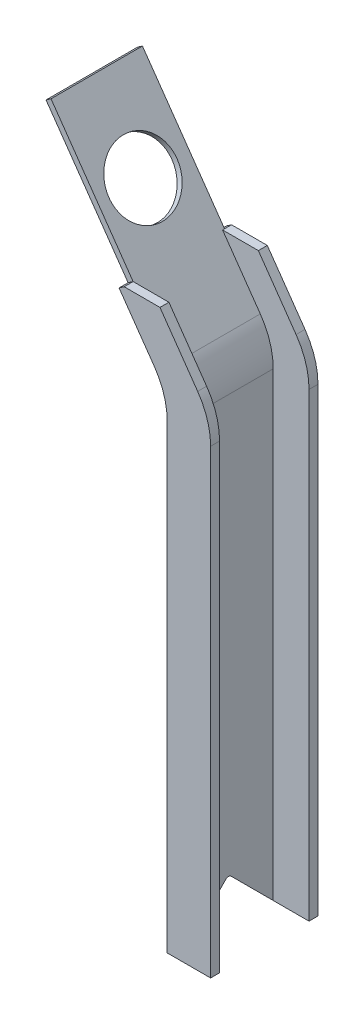
ISO-10303-21;
HEADER;
FILE_DESCRIPTION(('STEP AP214'),'2;1');
FILE_NAME('part.step','',(''),(''),'','','');
FILE_SCHEMA(('AUTOMOTIVE_DESIGN { 1 0 10303 214 1 1 1 1 }'));
ENDSEC;
DATA;
#1=APPLICATION_CONTEXT('core data for automotive mechanical design processes');
#2=APPLICATION_PROTOCOL_DEFINITION('international standard','automotive_design',2000,#1);
#3=PRODUCT_CONTEXT('',#1,'mechanical');
#4=PRODUCT('Part','Part','',(#3));
#5=PRODUCT_RELATED_PRODUCT_CATEGORY('part','',(#4));
#6=PRODUCT_DEFINITION_FORMATION('','',#4);
#7=PRODUCT_DEFINITION_CONTEXT('part definition',#1,'design');
#8=PRODUCT_DEFINITION('design','',#6,#7);
#9=PRODUCT_DEFINITION_SHAPE('','',#8);
#10=(LENGTH_UNIT() NAMED_UNIT(*) SI_UNIT(.MILLI.,.METRE.));
#11=(NAMED_UNIT(*) PLANE_ANGLE_UNIT() SI_UNIT($,.RADIAN.));
#12=(NAMED_UNIT(*) SI_UNIT($,.STERADIAN.) SOLID_ANGLE_UNIT());
#13=UNCERTAINTY_MEASURE_WITH_UNIT(LENGTH_MEASURE(1.E-05),#10,'distance_accuracy_value','');
#14=(GEOMETRIC_REPRESENTATION_CONTEXT(3) GLOBAL_UNCERTAINTY_ASSIGNED_CONTEXT((#13)) GLOBAL_UNIT_ASSIGNED_CONTEXT((#10,
#11,#12)) REPRESENTATION_CONTEXT('',''));
#15=CARTESIAN_POINT('',(0.,0.,0.));
#16=DIRECTION('',(0.,0.,1.));
#17=DIRECTION('',(1.,0.,0.));
#18=AXIS2_PLACEMENT_3D('',#15,#16,#17);
#19=CARTESIAN_POINT('',(5.40602308417781,0.,76.2));
#20=DIRECTION('',(0.,1.,0.));
#21=DIRECTION('',(-1.,0.,0.));
#22=AXIS2_PLACEMENT_3D('',#19,#20,#21);
#23=PLANE('',#22);
#24=DIRECTION('',(1.,0.,0.));
#25=VECTOR('',#24,1.);
#26=CARTESIAN_POINT('',(5.40602308417781,0.,6.35));
#27=LINE('',#26,#25);
#28=CARTESIAN_POINT('',(5.4060230841778,0.,6.35000000000002));
#29=VERTEX_POINT('',#28);
#30=CARTESIAN_POINT('',(30.8060230841778,0.,6.35));
#31=VERTEX_POINT('',#30);
#32=EDGE_CURVE('E277',#29,#31,#27,.T.);
#33=ORIENTED_EDGE('',*,*,#32,.F.);
#34=DIRECTION('',(1.,0.,0.));
#35=VECTOR('',#34,1.);
#36=CARTESIAN_POINT('',(-92.3713628433733,0.,6.35000000000002));
#37=LINE('',#36,#35);
#38=CARTESIAN_POINT('',(0.,0.,6.35000000000002));
#39=VERTEX_POINT('',#38);
#40=EDGE_CURVE('E227',#39,#29,#37,.T.);
#41=ORIENTED_EDGE('',*,*,#40,.F.);
#42=DIRECTION('',(0.,0.,-1.));
#43=VECTOR('',#42,1.);
#44=CARTESIAN_POINT('',(0.,0.,76.2));
#45=LINE('',#44,#43);
#46=CARTESIAN_POINT('',(0.,0.,0.));
#47=VERTEX_POINT('',#46);
#48=EDGE_CURVE('E333',#39,#47,#45,.T.);
#49=ORIENTED_EDGE('',*,*,#48,.T.);
#50=DIRECTION('',(1.,0.,0.));
#51=VECTOR('',#50,1.);
#52=CARTESIAN_POINT('',(5.40602308417781,0.,0.));
#53=LINE('',#52,#51);
#54=CARTESIAN_POINT('',(30.8060230841778,0.,0.));
#55=VERTEX_POINT('',#54);
#56=EDGE_CURVE('E318',#47,#55,#53,.T.);
#57=ORIENTED_EDGE('',*,*,#56,.T.);
#58=DIRECTION('',(0.,0.,-1.));
#59=VECTOR('',#58,1.);
#60=CARTESIAN_POINT('',(30.8060230841778,0.,6.35));
#61=LINE('',#60,#59);
#62=EDGE_CURVE('E314',#31,#55,#61,.T.);
#63=ORIENTED_EDGE('',*,*,#62,.F.);
#64=EDGE_LOOP('',(#33,#41,#49,#57,#63));
#65=FACE_BOUND('',#64,.T.);
#66=ADVANCED_FACE('F47',(#65),#23,.F.);
#67=CARTESIAN_POINT('',(-34.186394319992,391.723230905796,76.2));
#68=DIRECTION('',(0.573576436351037,-0.819152044288998,0.));
#69=DIRECTION('',(0.819152044288998,0.573576436351037,0.));
#70=AXIS2_PLACEMENT_3D('',#67,#68,#69);
#71=PLANE('',#70);
#72=DIRECTION('',(0.81915204428899,0.573576436351048,0.));
#73=VECTOR('',#72,1.);
#74=CARTESIAN_POINT('',(-34.0959969101068,391.786527853633,69.85));
#75=LINE('',#74,#73);
#76=CARTESIAN_POINT('',(-34.0959969101068,391.786527853633,69.85));
#77=VERTEX_POINT('',#76);
#78=CARTESIAN_POINT('',(-30.5588983828669,394.263230905796,69.85));
#79=VERTEX_POINT('',#78);
#80=EDGE_CURVE('E479',#77,#79,#75,.T.);
#81=ORIENTED_EDGE('',*,*,#80,.F.);
#82=DIRECTION('',(0.,0.,-1.));
#83=VECTOR('',#82,1.);
#84=CARTESIAN_POINT('',(-34.0959969101068,391.786527853633,69.85));
#85=LINE('',#84,#83);
#86=CARTESIAN_POINT('',(-34.0959969101068,391.786527853633,4.95491029302109));
#87=VERTEX_POINT('',#86);
#88=EDGE_CURVE('E513',#77,#87,#85,.T.);
#89=ORIENTED_EDGE('',*,*,#88,.T.);
#90=DIRECTION('',(0.81915204428899,0.573576436351048,0.));
#91=VECTOR('',#90,1.);
#92=CARTESIAN_POINT('',(-34.0959969101068,391.786527853633,4.95491029302109));
#93=LINE('',#92,#91);
#94=CARTESIAN_POINT('',(-30.5588983828669,394.263230905796,4.95491029302109));
#95=VERTEX_POINT('',#94);
#96=EDGE_CURVE('E482',#87,#95,#93,.T.);
#97=ORIENTED_EDGE('',*,*,#96,.T.);
#98=DIRECTION('',(0.,0.,-1.));
#99=VECTOR('',#98,1.);
#100=CARTESIAN_POINT('',(-30.5588983828669,394.263230905796,6.35));
#101=LINE('',#100,#99);
#102=CARTESIAN_POINT('',(-30.5588983828669,394.263230905796,0.));
#103=VERTEX_POINT('',#102);
#104=EDGE_CURVE('E296',#95,#103,#101,.T.);
#105=ORIENTED_EDGE('',*,*,#104,.T.);
#106=DIRECTION('',(-0.819152044288998,-0.573576436351037,0.));
#107=VECTOR('',#106,1.);
#108=CARTESIAN_POINT('',(-34.186394319992,391.723230905796,0.));
#109=LINE('',#108,#107);
#110=CARTESIAN_POINT('',(-34.186394319992,391.723230905796,0.));
#111=VERTEX_POINT('',#110);
#112=EDGE_CURVE('E336',#103,#111,#109,.T.);
#113=ORIENTED_EDGE('',*,*,#112,.T.);
#114=DIRECTION('',(0.,0.,-1.));
#115=VECTOR('',#114,1.);
#116=CARTESIAN_POINT('',(-34.186394319992,391.723230905796,76.2));
#117=LINE('',#116,#115);
#118=CARTESIAN_POINT('',(-34.186394319992,391.723230905796,76.2));
#119=VERTEX_POINT('',#118);
#120=EDGE_CURVE('E348',#119,#111,#117,.T.);
#121=ORIENTED_EDGE('',*,*,#120,.F.);
#122=DIRECTION('',(-0.819152044288998,-0.573576436351037,0.));
#123=VECTOR('',#122,1.);
#124=CARTESIAN_POINT('',(-34.186394319992,391.723230905796,76.2));
#125=LINE('',#124,#123);
#126=CARTESIAN_POINT('',(-30.5588983828669,394.263230905796,76.2));
#127=VERTEX_POINT('',#126);
#128=EDGE_CURVE('E322',#127,#119,#125,.T.);
#129=ORIENTED_EDGE('',*,*,#128,.F.);
#130=DIRECTION('',(0.,0.,-1.));
#131=VECTOR('',#130,1.);
#132=CARTESIAN_POINT('',(-30.5588983828669,394.263230905796,76.2));
#133=LINE('',#132,#131);
#134=EDGE_CURVE('E352',#127,#79,#133,.T.);
#135=ORIENTED_EDGE('',*,*,#134,.T.);
#136=EDGE_LOOP('',(#81,#89,#97,#105,#113,#121,#129,#135));
#137=FACE_BOUND('',#136,.T.);
#138=ADVANCED_FACE('F580',(#137),#71,.F.);
#139=CARTESIAN_POINT('',(5.40602308417779,342.9,76.2));
#140=DIRECTION('',(-1.,0.,0.));
#141=DIRECTION('',(0.,-1.,0.));
#142=AXIS2_PLACEMENT_3D('',#139,#140,#141);
#143=PLANE('',#142);
#144=DIRECTION('',(0.,0.707106781186547,-0.707106781186547));
#145=VECTOR('',#144,1.);
#146=CARTESIAN_POINT('',(5.4060230841778,168.275,-98.425));
#147=LINE('',#146,#145);
#148=CARTESIAN_POINT('',(5.40602308417781,0.,69.85));
#149=VERTEX_POINT('',#148);
#150=CARTESIAN_POINT('',(5.40602308417781,29.9539487757863,39.8960512242137));
#151=VERTEX_POINT('',#150);
#152=EDGE_CURVE('E204',#149,#151,#147,.T.);
#153=ORIENTED_EDGE('',*,*,#152,.T.);
#154=CARTESIAN_POINT('',(5.4060230841778,28.1578975515724,38.0999999999999));
#155=DIRECTION('',(-1.,0.,0.));
#156=DIRECTION('',(0.,-1.,0.));
#157=AXIS2_PLACEMENT_3D('',#154,#155,#156);
#158=CIRCLE('',#157,2.54);
#159=CARTESIAN_POINT('',(5.40602308417781,29.9539487757862,36.3039487757861));
#160=VERTEX_POINT('',#159);
#161=EDGE_CURVE('E56',#151,#160,#158,.T.);
#162=ORIENTED_EDGE('',*,*,#161,.T.);
#163=DIRECTION('',(0.,-0.70710678118655,-0.707106781186545));
#164=VECTOR('',#163,1.);
#165=CARTESIAN_POINT('',(5.4060230841778,206.375000000001,212.725));
#166=LINE('',#165,#164);
#167=EDGE_CURVE('E524',#160,#29,#166,.T.);
#168=ORIENTED_EDGE('',*,*,#167,.T.);
#169=DIRECTION('',(0.,-1.,0.));
#170=VECTOR('',#169,1.);
#171=CARTESIAN_POINT('',(5.40602308417779,342.9,6.35));
#172=LINE('',#171,#170);
#173=CARTESIAN_POINT('',(5.40602308417779,326.882821524948,6.35));
#174=VERTEX_POINT('',#173);
#175=EDGE_CURVE('E273',#174,#29,#172,.T.);
#176=ORIENTED_EDGE('',*,*,#175,.F.);
#177=DIRECTION('',(0.,0.,-1.));
#178=VECTOR('',#177,1.);
#179=CARTESIAN_POINT('',(5.40602308417779,326.882821524948,76.2));
#180=LINE('',#179,#178);
#181=CARTESIAN_POINT('',(5.40602308417779,326.882821524948,69.85));
#182=VERTEX_POINT('',#181);
#183=EDGE_CURVE('E234',#174,#182,#180,.F.);
#184=ORIENTED_EDGE('',*,*,#183,.T.);
#185=DIRECTION('',(0.,-1.,0.));
#186=VECTOR('',#185,1.);
#187=CARTESIAN_POINT('',(5.40602308417779,342.9,69.85));
#188=LINE('',#187,#186);
#189=EDGE_CURVE('E230',#182,#149,#188,.T.);
#190=ORIENTED_EDGE('',*,*,#189,.T.);
#191=EDGE_LOOP('',(#153,#162,#168,#176,#184,#190));
#192=FACE_BOUND('',#191,.T.);
#193=ADVANCED_FACE('F231',(#192),#143,.F.);
#194=CARTESIAN_POINT('',(-30.5588983828669,394.263230905796,76.2));
#195=DIRECTION('',(-0.819152044288991,-0.573576436351048,0.));
#196=DIRECTION('',(0.573576436351048,-0.81915204428899,0.));
#197=AXIS2_PLACEMENT_3D('',#194,#195,#196);
#198=PLANE('',#197);
#199=CARTESIAN_POINT('',(-55.3259289045052,429.634216178195,38.1));
#200=DIRECTION('',(0.819152044288991,0.573576436351048,0.));
#201=DIRECTION('',(-0.573576436351048,0.819152044288991,0.));
#202=AXIS2_PLACEMENT_3D('',#199,#200,#201);
#203=CIRCLE('',#202,24.13);
#204=CARTESIAN_POINT('',(-69.166328313656,449.400355006888,38.1));
#205=VERTEX_POINT('',#204);
#206=EDGE_CURVE('E505',#205,#205,#203,.T.);
#207=ORIENTED_EDGE('',*,*,#206,.F.);
#208=EDGE_LOOP('',(#207));
#209=FACE_BOUND('',#208,.T.);
#210=DIRECTION('',(0.573576436351048,-0.81915204428899,0.));
#211=VECTOR('',#210,1.);
#212=CARTESIAN_POINT('',(-30.5588983828669,394.263230905796,69.85));
#213=LINE('',#212,#211);
#214=CARTESIAN_POINT('',(-3.78105306594149,356.020504491581,69.85));
#215=VERTEX_POINT('',#214);
#216=EDGE_CURVE('E259',#79,#215,#213,.T.);
#217=ORIENTED_EDGE('',*,*,#216,.T.);
#218=DIRECTION('',(0.,0.,-1.));
#219=VECTOR('',#218,1.);
#220=CARTESIAN_POINT('',(-3.78105306594147,356.020504491581,76.2));
#221=LINE('',#220,#219);
#222=CARTESIAN_POINT('',(-3.78105306594149,356.020504491581,6.35));
#223=VERTEX_POINT('',#222);
#224=EDGE_CURVE('E376',#215,#223,#221,.T.);
#225=ORIENTED_EDGE('',*,*,#224,.T.);
#226=DIRECTION('',(0.573576436351048,-0.81915204428899,0.));
#227=VECTOR('',#226,1.);
#228=CARTESIAN_POINT('',(-30.5588983828669,394.263230905796,6.35));
#229=LINE('',#228,#227);
#230=CARTESIAN_POINT('',(-30.5588983828669,394.263230905796,6.35000000000002));
#231=VERTEX_POINT('',#230);
#232=EDGE_CURVE('E292',#231,#223,#229,.T.);
#233=ORIENTED_EDGE('',*,*,#232,.F.);
#234=EDGE_CURVE('E306',#231,#95,#101,.T.);
#235=ORIENTED_EDGE('',*,*,#234,.T.);
#236=DIRECTION('',(-0.573576436351048,0.81915204428899,0.));
#237=VECTOR('',#236,1.);
#238=CARTESIAN_POINT('',(-30.5588983828669,394.263230905796,4.95491029302109));
#239=LINE('',#238,#237);
#240=CARTESIAN_POINT('',(-88.8342643161334,477.489078605558,4.95491029302109));
#241=VERTEX_POINT('',#240);
#242=EDGE_CURVE('E497',#95,#241,#239,.T.);
#243=ORIENTED_EDGE('',*,*,#242,.T.);
#244=DIRECTION('',(0.,0.,1.));
#245=VECTOR('',#244,1.);
#246=CARTESIAN_POINT('',(-88.8342643161334,477.489078605558,69.85));
#247=LINE('',#246,#245);
#248=CARTESIAN_POINT('',(-88.8342643161334,477.489078605558,69.85));
#249=VERTEX_POINT('',#248);
#250=EDGE_CURVE('E492',#241,#249,#247,.T.);
#251=ORIENTED_EDGE('',*,*,#250,.T.);
#252=DIRECTION('',(0.573576436351048,-0.81915204428899,0.));
#253=VECTOR('',#252,1.);
#254=CARTESIAN_POINT('',(-30.5588983828669,394.263230905796,69.85));
#255=LINE('',#254,#253);
#256=EDGE_CURVE('E501',#249,#79,#255,.T.);
#257=ORIENTED_EDGE('',*,*,#256,.T.);
#258=EDGE_LOOP('',(#217,#225,#233,#235,#243,#251,#257));
#259=FACE_BOUND('',#258,.T.);
#260=ADVANCED_FACE('F571',(#209,#259),#198,.F.);
#261=CARTESIAN_POINT('',(0.,0.,76.2));
#262=VERTEX_POINT('',#261);
#263=CARTESIAN_POINT('',(0.,0.,69.85));
#264=VERTEX_POINT('',#263);
#265=EDGE_CURVE('E225',#262,#264,#45,.T.);
#266=ORIENTED_EDGE('',*,*,#265,.T.);
#267=DIRECTION('',(1.,0.,0.));
#268=VECTOR('',#267,1.);
#269=CARTESIAN_POINT('',(-92.3713628433733,0.,69.85));
#270=LINE('',#269,#268);
#271=EDGE_CURVE('E208',#264,#149,#270,.T.);
#272=ORIENTED_EDGE('',*,*,#271,.T.);
#273=DIRECTION('',(1.,0.,0.));
#274=VECTOR('',#273,1.);
#275=CARTESIAN_POINT('',(5.40602308417781,0.,69.85));
#276=LINE('',#275,#274);
#277=CARTESIAN_POINT('',(30.8060230841778,0.,69.85));
#278=VERTEX_POINT('',#277);
#279=EDGE_CURVE('E221',#149,#278,#276,.T.);
#280=ORIENTED_EDGE('',*,*,#279,.T.);
#281=DIRECTION('',(0.,0.,-1.));
#282=VECTOR('',#281,1.);
#283=CARTESIAN_POINT('',(30.8060230841778,0.,76.2));
#284=LINE('',#283,#282);
#285=CARTESIAN_POINT('',(30.8060230841778,0.,76.2));
#286=VERTEX_POINT('',#285);
#287=EDGE_CURVE('E268',#286,#278,#284,.T.);
#288=ORIENTED_EDGE('',*,*,#287,.F.);
#289=DIRECTION('',(1.,0.,0.));
#290=VECTOR('',#289,1.);
#291=CARTESIAN_POINT('',(5.40602308417781,0.,76.2));
#292=LINE('',#291,#290);
#293=EDGE_CURVE('E319',#262,#286,#292,.T.);
#294=ORIENTED_EDGE('',*,*,#293,.F.);
#295=EDGE_LOOP('',(#266,#272,#280,#288,#294));
#296=FACE_BOUND('',#295,.T.);
#297=ADVANCED_FACE('F218',(#296),#23,.F.);
#298=CARTESIAN_POINT('',(0.,342.9,76.2));
#299=DIRECTION('',(0.81915204428899,0.573576436351048,0.));
#300=DIRECTION('',(-0.573576436351048,0.81915204428899,0.));
#301=AXIS2_PLACEMENT_3D('',#298,#299,#300);
#302=PLANE('',#301);
#303=DIRECTION('',(0.573576436351048,-0.81915204428899,0.));
#304=VECTOR('',#303,1.);
#305=CARTESIAN_POINT('',(0.,342.9,0.));
#306=LINE('',#305,#304);
#307=CARTESIAN_POINT('',(-9.18707615011929,356.020504491581,0.));
#308=VERTEX_POINT('',#307);
#309=EDGE_CURVE('E339',#111,#308,#306,.T.);
#310=ORIENTED_EDGE('',*,*,#309,.T.);
#311=DIRECTION('',(0.,0.,-1.));
#312=VECTOR('',#311,1.);
#313=CARTESIAN_POINT('',(-9.18707615011929,356.020504491581,76.2));
#314=LINE('',#313,#312);
#315=CARTESIAN_POINT('',(-9.18707615011929,356.020504491581,76.2));
#316=VERTEX_POINT('',#315);
#317=EDGE_CURVE('E360',#308,#316,#314,.F.);
#318=ORIENTED_EDGE('',*,*,#317,.T.);
#319=DIRECTION('',(0.573576436351048,-0.81915204428899,0.));
#320=VECTOR('',#319,1.);
#321=CARTESIAN_POINT('',(0.,342.9,76.2));
#322=LINE('',#321,#320);
#323=EDGE_CURVE('E326',#119,#316,#322,.T.);
#324=ORIENTED_EDGE('',*,*,#323,.F.);
#325=ORIENTED_EDGE('',*,*,#120,.T.);
#326=EDGE_LOOP('',(#310,#318,#324,#325));
#327=FACE_BOUND('',#326,.T.);
#328=ADVANCED_FACE('F616',(#327),#302,.F.);
#329=CARTESIAN_POINT('',(0.,0.,76.2));
#330=DIRECTION('',(1.,0.,0.));
#331=DIRECTION('',(0.,0.,-1.));
#332=AXIS2_PLACEMENT_3D('',#329,#330,#331);
#333=PLANE('',#332);
#334=ORIENTED_EDGE('',*,*,#48,.F.);
#335=DIRECTION('',(0.,0.70710678118655,0.707106781186545));
#336=VECTOR('',#335,1.);
#337=CARTESIAN_POINT('',(0.,34.925,41.2749999999997));
#338=LINE('',#337,#336);
#339=CARTESIAN_POINT('',(0.,29.9539487757863,36.3039487757861));
#340=VERTEX_POINT('',#339);
#341=EDGE_CURVE('E214',#39,#340,#338,.T.);
#342=ORIENTED_EDGE('',*,*,#341,.T.);
#343=CARTESIAN_POINT('',(0.,28.1578975515724,38.0999999999999));
#344=DIRECTION('',(1.,0.,0.));
#345=DIRECTION('',(0.,0.,-1.));
#346=AXIS2_PLACEMENT_3D('',#343,#344,#345);
#347=CIRCLE('',#346,2.54);
#348=CARTESIAN_POINT('',(0.,29.9539487757863,39.8960512242137));
#349=VERTEX_POINT('',#348);
#350=EDGE_CURVE('E11',#340,#349,#347,.T.);
#351=ORIENTED_EDGE('',*,*,#350,.T.);
#352=DIRECTION('',(0.,-0.707106781186547,0.707106781186547));
#353=VECTOR('',#352,1.);
#354=CARTESIAN_POINT('',(0.,-3.175,73.025));
#355=LINE('',#354,#353);
#356=EDGE_CURVE('E215',#349,#264,#355,.T.);
#357=ORIENTED_EDGE('',*,*,#356,.T.);
#358=ORIENTED_EDGE('',*,*,#265,.F.);
#359=DIRECTION('',(0.,-1.,0.));
#360=VECTOR('',#359,1.);
#361=CARTESIAN_POINT('',(0.,0.,76.2));
#362=LINE('',#361,#360);
#363=CARTESIAN_POINT('',(0.,326.882821524948,76.2));
#364=VERTEX_POINT('',#363);
#365=EDGE_CURVE('E330',#364,#262,#362,.T.);
#366=ORIENTED_EDGE('',*,*,#365,.F.);
#367=DIRECTION('',(0.,0.,-1.));
#368=VECTOR('',#367,1.);
#369=CARTESIAN_POINT('',(0.,326.882821524948,0.));
#370=LINE('',#369,#368);
#371=CARTESIAN_POINT('',(0.,326.882821524948,0.));
#372=VERTEX_POINT('',#371);
#373=EDGE_CURVE('E356',#364,#372,#370,.T.);
#374=ORIENTED_EDGE('',*,*,#373,.T.);
#375=DIRECTION('',(0.,-1.,0.));
#376=VECTOR('',#375,1.);
#377=CARTESIAN_POINT('',(0.,0.,0.));
#378=LINE('',#377,#376);
#379=EDGE_CURVE('E323',#372,#47,#378,.T.);
#380=ORIENTED_EDGE('',*,*,#379,.T.);
#381=EDGE_LOOP('',(#334,#342,#351,#357,#358,#366,#374,#380));
#382=FACE_BOUND('',#381,.T.);
#383=ADVANCED_FACE('F621',(#382),#333,.F.);
#384=CARTESIAN_POINT('',(0.,0.,76.2));
#385=DIRECTION('',(0.,0.,-1.));
#386=DIRECTION('',(-1.,0.,0.));
#387=AXIS2_PLACEMENT_3D('',#384,#385,#386);
#388=PLANE('',#387);
#389=DIRECTION('',(0.,1.,0.));
#390=VECTOR('',#389,1.);
#391=CARTESIAN_POINT('',(30.8060230841778,0.,76.2));
#392=LINE('',#391,#390);
#393=CARTESIAN_POINT('',(30.8060230841778,326.882821524948,76.2));
#394=VERTEX_POINT('',#393);
#395=EDGE_CURVE('E263',#286,#394,#392,.T.);
#396=ORIENTED_EDGE('',*,*,#395,.T.);
#397=CARTESIAN_POINT('',(-19.9939769158222,326.882821524948,76.2));
#398=DIRECTION('',(0.,0.,-1.));
#399=DIRECTION('',(-1.,0.,0.));
#400=AXIS2_PLACEMENT_3D('',#397,#398,#399);
#401=CIRCLE('',#400,50.8);
#402=CARTESIAN_POINT('',(21.6189469340585,356.020504491581,76.2));
#403=VERTEX_POINT('',#402);
#404=EDGE_CURVE('E392',#394,#403,#401,.F.);
#405=ORIENTED_EDGE('',*,*,#404,.T.);
#406=DIRECTION('',(-0.573576436351048,0.81915204428899,0.));
#407=VECTOR('',#406,1.);
#408=CARTESIAN_POINT('',(30.8060230841778,342.9,76.2));
#409=LINE('',#408,#407);
#410=CARTESIAN_POINT('',(-5.15889838286693,394.263230905796,76.2));
#411=VERTEX_POINT('',#410);
#412=EDGE_CURVE('E464',#403,#411,#409,.T.);
#413=ORIENTED_EDGE('',*,*,#412,.T.);
#414=DIRECTION('',(-1.,0.,0.));
#415=VECTOR('',#414,1.);
#416=CARTESIAN_POINT('',(-5.15889838286693,394.263230905796,76.2));
#417=LINE('',#416,#415);
#418=EDGE_CURVE('E269',#411,#127,#417,.T.);
#419=ORIENTED_EDGE('',*,*,#418,.T.);
#420=ORIENTED_EDGE('',*,*,#128,.T.);
#421=ORIENTED_EDGE('',*,*,#323,.T.);
#422=CARTESIAN_POINT('',(-50.8,326.882821524948,76.2));
#423=DIRECTION('',(0.,0.,-1.));
#424=DIRECTION('',(-1.,0.,0.));
#425=AXIS2_PLACEMENT_3D('',#422,#423,#424);
#426=CIRCLE('',#425,50.8);
#427=EDGE_CURVE('E398',#316,#364,#426,.T.);
#428=ORIENTED_EDGE('',*,*,#427,.T.);
#429=ORIENTED_EDGE('',*,*,#365,.T.);
#430=ORIENTED_EDGE('',*,*,#293,.T.);
#431=EDGE_LOOP('',(#396,#405,#413,#419,#420,#421,#428,#429,#430));
#432=FACE_BOUND('',#431,.T.);
#433=ADVANCED_FACE('F585',(#432),#388,.F.);
#434=CARTESIAN_POINT('',(0.,0.,0.));
#435=DIRECTION('',(0.,0.,-1.));
#436=DIRECTION('',(-1.,0.,0.));
#437=AXIS2_PLACEMENT_3D('',#434,#435,#436);
#438=PLANE('',#437);
#439=DIRECTION('',(-0.573576436351048,0.81915204428899,0.));
#440=VECTOR('',#439,1.);
#441=CARTESIAN_POINT('',(30.8060230841778,342.9,0.));
#442=LINE('',#441,#440);
#443=CARTESIAN_POINT('',(21.6189469340585,356.020504491581,0.));
#444=VERTEX_POINT('',#443);
#445=CARTESIAN_POINT('',(-5.15889838286693,394.263230905796,0.));
#446=VERTEX_POINT('',#445);
#447=EDGE_CURVE('E300',#444,#446,#442,.T.);
#448=ORIENTED_EDGE('',*,*,#447,.F.);
#449=CARTESIAN_POINT('',(-19.9939769158222,326.882821524948,0.));
#450=DIRECTION('',(0.,0.,-1.));
#451=DIRECTION('',(-1.,0.,0.));
#452=AXIS2_PLACEMENT_3D('',#449,#450,#451);
#453=CIRCLE('',#452,50.8);
#454=CARTESIAN_POINT('',(30.8060230841778,326.882821524948,0.));
#455=VERTEX_POINT('',#454);
#456=EDGE_CURVE('E367',#444,#455,#453,.T.);
#457=ORIENTED_EDGE('',*,*,#456,.T.);
#458=DIRECTION('',(0.,1.,0.));
#459=VECTOR('',#458,1.);
#460=CARTESIAN_POINT('',(30.8060230841778,0.,0.));
#461=LINE('',#460,#459);
#462=EDGE_CURVE('E272',#55,#455,#461,.T.);
#463=ORIENTED_EDGE('',*,*,#462,.F.);
#464=ORIENTED_EDGE('',*,*,#56,.F.);
#465=ORIENTED_EDGE('',*,*,#379,.F.);
#466=CARTESIAN_POINT('',(-50.8,326.882821524948,0.));
#467=DIRECTION('',(0.,0.,-1.));
#468=DIRECTION('',(-1.,0.,0.));
#469=AXIS2_PLACEMENT_3D('',#466,#467,#468);
#470=CIRCLE('',#469,50.8);
#471=EDGE_CURVE('E395',#372,#308,#470,.F.);
#472=ORIENTED_EDGE('',*,*,#471,.T.);
#473=ORIENTED_EDGE('',*,*,#309,.F.);
#474=ORIENTED_EDGE('',*,*,#112,.F.);
#475=DIRECTION('',(-1.,0.,0.));
#476=VECTOR('',#475,1.);
#477=CARTESIAN_POINT('',(-5.15889838286693,394.263230905796,0.));
#478=LINE('',#477,#476);
#479=EDGE_CURVE('E278',#446,#103,#478,.T.);
#480=ORIENTED_EDGE('',*,*,#479,.F.);
#481=EDGE_LOOP('',(#448,#457,#463,#464,#465,#472,#473,#474,#480));
#482=FACE_BOUND('',#481,.T.);
#483=ADVANCED_FACE('F562',(#482),#438,.T.);
#484=CARTESIAN_POINT('',(30.8060230841778,0.,6.35));
#485=DIRECTION('',(-1.,0.,0.));
#486=DIRECTION('',(0.,0.,1.));
#487=AXIS2_PLACEMENT_3D('',#484,#485,#486);
#488=PLANE('',#487);
#489=ORIENTED_EDGE('',*,*,#462,.T.);
#490=DIRECTION('',(0.,0.,-1.));
#491=VECTOR('',#490,1.);
#492=CARTESIAN_POINT('',(30.8060230841778,326.882821524948,6.35));
#493=LINE('',#492,#491);
#494=CARTESIAN_POINT('',(30.8060230841778,326.882821524948,6.35));
#495=VERTEX_POINT('',#494);
#496=EDGE_CURVE('E370',#455,#495,#493,.F.);
#497=ORIENTED_EDGE('',*,*,#496,.T.);
#498=DIRECTION('',(0.,1.,0.));
#499=VECTOR('',#498,1.);
#500=CARTESIAN_POINT('',(30.8060230841778,0.,6.35));
#501=LINE('',#500,#499);
#502=EDGE_CURVE('E281',#31,#495,#501,.T.);
#503=ORIENTED_EDGE('',*,*,#502,.F.);
#504=ORIENTED_EDGE('',*,*,#62,.T.);
#505=EDGE_LOOP('',(#489,#497,#503,#504));
#506=FACE_BOUND('',#505,.T.);
#507=ADVANCED_FACE('F549',(#506),#488,.F.);
#508=CARTESIAN_POINT('',(30.8060230841778,342.9,6.35));
#509=DIRECTION('',(-0.81915204428899,-0.573576436351048,0.));
#510=DIRECTION('',(0.573576436351048,-0.819152044288991,0.));
#511=AXIS2_PLACEMENT_3D('',#508,#509,#510);
#512=PLANE('',#511);
#513=DIRECTION('',(-0.573576436351048,0.81915204428899,0.));
#514=VECTOR('',#513,1.);
#515=CARTESIAN_POINT('',(30.8060230841778,342.9,6.35));
#516=LINE('',#515,#514);
#517=CARTESIAN_POINT('',(21.6189469340585,356.020504491581,6.35));
#518=VERTEX_POINT('',#517);
#519=CARTESIAN_POINT('',(-5.15889838286693,394.263230905796,6.35));
#520=VERTEX_POINT('',#519);
#521=EDGE_CURVE('E285',#518,#520,#516,.T.);
#522=ORIENTED_EDGE('',*,*,#521,.F.);
#523=DIRECTION('',(0.,0.,-1.));
#524=VECTOR('',#523,1.);
#525=CARTESIAN_POINT('',(21.6189469340585,356.020504491581,6.35));
#526=LINE('',#525,#524);
#527=EDGE_CURVE('E363',#518,#444,#526,.T.);
#528=ORIENTED_EDGE('',*,*,#527,.T.);
#529=ORIENTED_EDGE('',*,*,#447,.T.);
#530=DIRECTION('',(0.,0.,-1.));
#531=VECTOR('',#530,1.);
#532=CARTESIAN_POINT('',(-5.15889838286693,394.263230905796,6.35));
#533=LINE('',#532,#531);
#534=EDGE_CURVE('E310',#520,#446,#533,.T.);
#535=ORIENTED_EDGE('',*,*,#534,.F.);
#536=EDGE_LOOP('',(#522,#528,#529,#535));
#537=FACE_BOUND('',#536,.T.);
#538=ADVANCED_FACE('F558',(#537),#512,.F.);
#539=CARTESIAN_POINT('',(-5.15889838286693,394.263230905796,6.35));
#540=DIRECTION('',(0.,-1.,0.));
#541=DIRECTION('',(0.,0.,-1.));
#542=AXIS2_PLACEMENT_3D('',#539,#540,#541);
#543=PLANE('',#542);
#544=ORIENTED_EDGE('',*,*,#479,.T.);
#545=ORIENTED_EDGE('',*,*,#104,.F.);
#546=ORIENTED_EDGE('',*,*,#234,.F.);
#547=DIRECTION('',(-1.,0.,0.));
#548=VECTOR('',#547,1.);
#549=CARTESIAN_POINT('',(-5.15889838286693,394.263230905796,6.35));
#550=LINE('',#549,#548);
#551=EDGE_CURVE('E288',#520,#231,#550,.T.);
#552=ORIENTED_EDGE('',*,*,#551,.F.);
#553=ORIENTED_EDGE('',*,*,#534,.T.);
#554=EDGE_LOOP('',(#544,#545,#546,#552,#553));
#555=FACE_BOUND('',#554,.T.);
#556=ADVANCED_FACE('F567',(#555),#543,.F.);
#557=CARTESIAN_POINT('',(0.,0.,6.35));
#558=DIRECTION('',(0.,0.,1.));
#559=DIRECTION('',(1.,0.,0.));
#560=AXIS2_PLACEMENT_3D('',#557,#558,#559);
#561=PLANE('',#560);
#562=ORIENTED_EDGE('',*,*,#502,.T.);
#563=CARTESIAN_POINT('',(-19.9939769158222,326.882821524948,6.35));
#564=DIRECTION('',(0.,0.,1.));
#565=DIRECTION('',(1.,0.,0.));
#566=AXIS2_PLACEMENT_3D('',#563,#564,#565);
#567=CIRCLE('',#566,50.8);
#568=EDGE_CURVE('E373',#495,#518,#567,.T.);
#569=ORIENTED_EDGE('',*,*,#568,.T.);
#570=ORIENTED_EDGE('',*,*,#521,.T.);
#571=ORIENTED_EDGE('',*,*,#551,.T.);
#572=ORIENTED_EDGE('',*,*,#232,.T.);
#573=CARTESIAN_POINT('',(-45.3939769158222,326.882821524948,6.34999999999999));
#574=DIRECTION('',(0.,0.,1.));
#575=DIRECTION('',(1.,0.,0.));
#576=AXIS2_PLACEMENT_3D('',#573,#574,#575);
#577=CIRCLE('',#576,50.8);
#578=EDGE_CURVE('E401',#223,#174,#577,.F.);
#579=ORIENTED_EDGE('',*,*,#578,.T.);
#580=ORIENTED_EDGE('',*,*,#175,.T.);
#581=ORIENTED_EDGE('',*,*,#32,.T.);
#582=EDGE_LOOP('',(#562,#569,#570,#571,#572,#579,#580,#581));
#583=FACE_BOUND('',#582,.T.);
#584=ADVANCED_FACE('F543',(#583),#561,.T.);
#585=CARTESIAN_POINT('',(30.8060230841778,0.,76.2));
#586=DIRECTION('',(-1.,0.,0.));
#587=DIRECTION('',(0.,0.,1.));
#588=AXIS2_PLACEMENT_3D('',#585,#586,#587);
#589=PLANE('',#588);
#590=DIRECTION('',(0.,1.,0.));
#591=VECTOR('',#590,1.);
#592=CARTESIAN_POINT('',(30.8060230841778,0.,69.85));
#593=LINE('',#592,#591);
#594=CARTESIAN_POINT('',(30.8060230841778,326.882821524948,69.85));
#595=VERTEX_POINT('',#594);
#596=EDGE_CURVE('E244',#278,#595,#593,.T.);
#597=ORIENTED_EDGE('',*,*,#596,.T.);
#598=DIRECTION('',(0.,0.,-1.));
#599=VECTOR('',#598,1.);
#600=CARTESIAN_POINT('',(30.8060230841778,326.882821524948,76.2));
#601=LINE('',#600,#599);
#602=EDGE_CURVE('E389',#595,#394,#601,.F.);
#603=ORIENTED_EDGE('',*,*,#602,.T.);
#604=ORIENTED_EDGE('',*,*,#395,.F.);
#605=ORIENTED_EDGE('',*,*,#287,.T.);
#606=EDGE_LOOP('',(#597,#603,#604,#605));
#607=FACE_BOUND('',#606,.T.);
#608=ADVANCED_FACE('F594',(#607),#589,.F.);
#609=CARTESIAN_POINT('',(30.8060230841778,342.9,76.2));
#610=DIRECTION('',(-0.81915204428899,-0.573576436351048,0.));
#611=DIRECTION('',(0.573576436351048,-0.819152044288991,0.));
#612=AXIS2_PLACEMENT_3D('',#609,#610,#611);
#613=PLANE('',#612);
#614=ORIENTED_EDGE('',*,*,#412,.F.);
#615=DIRECTION('',(0.,0.,-1.));
#616=VECTOR('',#615,1.);
#617=CARTESIAN_POINT('',(21.6189469340585,356.020504491581,76.2));
#618=LINE('',#617,#616);
#619=CARTESIAN_POINT('',(21.6189469340585,356.020504491581,69.85));
#620=VERTEX_POINT('',#619);
#621=EDGE_CURVE('E382',#403,#620,#618,.T.);
#622=ORIENTED_EDGE('',*,*,#621,.T.);
#623=DIRECTION('',(-0.573576436351048,0.81915204428899,0.));
#624=VECTOR('',#623,1.);
#625=CARTESIAN_POINT('',(30.8060230841778,342.9,69.85));
#626=LINE('',#625,#624);
#627=CARTESIAN_POINT('',(-5.15889838286693,394.263230905796,69.85));
#628=VERTEX_POINT('',#627);
#629=EDGE_CURVE('E249',#620,#628,#626,.T.);
#630=ORIENTED_EDGE('',*,*,#629,.T.);
#631=DIRECTION('',(0.,0.,-1.));
#632=VECTOR('',#631,1.);
#633=CARTESIAN_POINT('',(-5.15889838286693,394.263230905796,76.2));
#634=LINE('',#633,#632);
#635=EDGE_CURVE('E264',#411,#628,#634,.T.);
#636=ORIENTED_EDGE('',*,*,#635,.F.);
#637=EDGE_LOOP('',(#614,#622,#630,#636));
#638=FACE_BOUND('',#637,.T.);
#639=ADVANCED_FACE('F590',(#638),#613,.F.);
#640=CARTESIAN_POINT('',(-5.15889838286693,394.263230905796,76.2));
#641=DIRECTION('',(0.,-1.,0.));
#642=DIRECTION('',(0.,0.,-1.));
#643=AXIS2_PLACEMENT_3D('',#640,#641,#642);
#644=PLANE('',#643);
#645=DIRECTION('',(-1.,0.,0.));
#646=VECTOR('',#645,1.);
#647=CARTESIAN_POINT('',(-5.15889838286693,394.263230905796,69.85));
#648=LINE('',#647,#646);
#649=EDGE_CURVE('E255',#628,#79,#648,.T.);
#650=ORIENTED_EDGE('',*,*,#649,.T.);
#651=ORIENTED_EDGE('',*,*,#134,.F.);
#652=ORIENTED_EDGE('',*,*,#418,.F.);
#653=ORIENTED_EDGE('',*,*,#635,.T.);
#654=EDGE_LOOP('',(#650,#651,#652,#653));
#655=FACE_BOUND('',#654,.T.);
#656=ADVANCED_FACE('F584',(#655),#644,.F.);
#657=CARTESIAN_POINT('',(0.,0.,69.85));
#658=DIRECTION('',(0.,0.,1.));
#659=DIRECTION('',(1.,0.,0.));
#660=AXIS2_PLACEMENT_3D('',#657,#658,#659);
#661=PLANE('',#660);
#662=ORIENTED_EDGE('',*,*,#629,.F.);
#663=CARTESIAN_POINT('',(-19.9939769158222,326.882821524948,69.85));
#664=DIRECTION('',(0.,0.,1.));
#665=DIRECTION('',(1.,0.,0.));
#666=AXIS2_PLACEMENT_3D('',#663,#664,#665);
#667=CIRCLE('',#666,50.8);
#668=EDGE_CURVE('E386',#620,#595,#667,.F.);
#669=ORIENTED_EDGE('',*,*,#668,.T.);
#670=ORIENTED_EDGE('',*,*,#596,.F.);
#671=ORIENTED_EDGE('',*,*,#279,.F.);
#672=ORIENTED_EDGE('',*,*,#189,.F.);
#673=CARTESIAN_POINT('',(-45.3939769158222,326.882821524948,69.85));
#674=DIRECTION('',(0.,0.,1.));
#675=DIRECTION('',(1.,0.,0.));
#676=AXIS2_PLACEMENT_3D('',#673,#674,#675);
#677=CIRCLE('',#676,50.8);
#678=EDGE_CURVE('E404',#182,#215,#677,.T.);
#679=ORIENTED_EDGE('',*,*,#678,.T.);
#680=ORIENTED_EDGE('',*,*,#216,.F.);
#681=ORIENTED_EDGE('',*,*,#649,.F.);
#682=EDGE_LOOP('',(#662,#669,#670,#671,#672,#679,#680,#681));
#683=FACE_BOUND('',#682,.T.);
#684=ADVANCED_FACE('F242',(#683),#661,.F.);
#685=CARTESIAN_POINT('',(-50.8,326.882821524948,76.2));
#686=DIRECTION('',(0.,0.,1.));
#687=DIRECTION('',(1.,0.,0.));
#688=AXIS2_PLACEMENT_3D('',#685,#686,#687);
#689=CYLINDRICAL_SURFACE('',#688,50.8);
#690=ORIENTED_EDGE('',*,*,#427,.F.);
#691=ORIENTED_EDGE('',*,*,#317,.F.);
#692=ORIENTED_EDGE('',*,*,#471,.F.);
#693=ORIENTED_EDGE('',*,*,#373,.F.);
#694=EDGE_LOOP('',(#690,#691,#692,#693));
#695=FACE_BOUND('',#694,.T.);
#696=ADVANCED_FACE('F655',(#695),#689,.F.);
#697=CARTESIAN_POINT('',(-19.9939769158222,326.882821524948,6.35));
#698=DIRECTION('',(0.,0.,-1.));
#699=DIRECTION('',(-1.,0.,0.));
#700=AXIS2_PLACEMENT_3D('',#697,#698,#699);
#701=CYLINDRICAL_SURFACE('',#700,50.8);
#702=ORIENTED_EDGE('',*,*,#568,.F.);
#703=ORIENTED_EDGE('',*,*,#496,.F.);
#704=ORIENTED_EDGE('',*,*,#456,.F.);
#705=ORIENTED_EDGE('',*,*,#527,.F.);
#706=EDGE_LOOP('',(#702,#703,#704,#705));
#707=FACE_BOUND('',#706,.T.);
#708=ADVANCED_FACE('F555',(#707),#701,.T.);
#709=CARTESIAN_POINT('',(-45.3939769158222,326.882821524948,76.2));
#710=DIRECTION('',(0.,0.,-1.));
#711=DIRECTION('',(-1.,0.,0.));
#712=AXIS2_PLACEMENT_3D('',#709,#710,#711);
#713=CYLINDRICAL_SURFACE('',#712,50.8);
#714=ORIENTED_EDGE('',*,*,#678,.F.);
#715=ORIENTED_EDGE('',*,*,#183,.F.);
#716=ORIENTED_EDGE('',*,*,#578,.F.);
#717=ORIENTED_EDGE('',*,*,#224,.F.);
#718=EDGE_LOOP('',(#714,#715,#716,#717));
#719=FACE_BOUND('',#718,.T.);
#720=ADVANCED_FACE('F575',(#719),#713,.T.);
#721=CARTESIAN_POINT('',(-19.9939769158222,326.882821524948,76.2));
#722=DIRECTION('',(0.,0.,-1.));
#723=DIRECTION('',(-1.,0.,0.));
#724=AXIS2_PLACEMENT_3D('',#721,#722,#723);
#725=CYLINDRICAL_SURFACE('',#724,50.8);
#726=ORIENTED_EDGE('',*,*,#404,.F.);
#727=ORIENTED_EDGE('',*,*,#602,.F.);
#728=ORIENTED_EDGE('',*,*,#668,.F.);
#729=ORIENTED_EDGE('',*,*,#621,.F.);
#730=EDGE_LOOP('',(#726,#727,#728,#729));
#731=FACE_BOUND('',#730,.T.);
#732=ADVANCED_FACE('F595',(#731),#725,.T.);
#733=CARTESIAN_POINT('',(-34.0959969101068,391.786527853633,69.85));
#734=DIRECTION('',(0.,0.,1.));
#735=DIRECTION('',(1.,0.,0.));
#736=AXIS2_PLACEMENT_3D('',#733,#734,#735);
#737=PLANE('',#736);
#738=ORIENTED_EDGE('',*,*,#256,.F.);
#739=DIRECTION('',(0.81915204428899,0.573576436351048,0.));
#740=VECTOR('',#739,1.);
#741=CARTESIAN_POINT('',(-92.3713628433733,475.012375553394,69.85));
#742=LINE('',#741,#740);
#743=CARTESIAN_POINT('',(-92.3713628433733,475.012375553394,69.85));
#744=VERTEX_POINT('',#743);
#745=EDGE_CURVE('E238',#744,#249,#742,.T.);
#746=ORIENTED_EDGE('',*,*,#745,.F.);
#747=DIRECTION('',(0.573576436351048,-0.81915204428899,0.));
#748=VECTOR('',#747,1.);
#749=CARTESIAN_POINT('',(-34.0959969101068,391.786527853633,69.85));
#750=LINE('',#749,#748);
#751=EDGE_CURVE('E496',#744,#77,#750,.T.);
#752=ORIENTED_EDGE('',*,*,#751,.T.);
#753=ORIENTED_EDGE('',*,*,#80,.T.);
#754=EDGE_LOOP('',(#738,#746,#752,#753));
#755=FACE_BOUND('',#754,.T.);
#756=ADVANCED_FACE('F597',(#755),#737,.T.);
#757=CARTESIAN_POINT('',(-92.3713628433733,475.012375553394,69.85));
#758=DIRECTION('',(-0.573576436351048,0.81915204428899,0.));
#759=DIRECTION('',(-0.81915204428899,-0.573576436351048,0.));
#760=AXIS2_PLACEMENT_3D('',#757,#758,#759);
#761=PLANE('',#760);
#762=ORIENTED_EDGE('',*,*,#250,.F.);
#763=DIRECTION('',(0.81915204428899,0.573576436351048,0.));
#764=VECTOR('',#763,1.);
#765=CARTESIAN_POINT('',(-92.3713628433733,475.012375553394,4.95491029302109));
#766=LINE('',#765,#764);
#767=CARTESIAN_POINT('',(-92.3713628433733,475.012375553394,4.95491029302109));
#768=VERTEX_POINT('',#767);
#769=EDGE_CURVE('E487',#768,#241,#766,.T.);
#770=ORIENTED_EDGE('',*,*,#769,.F.);
#771=DIRECTION('',(0.,0.,1.));
#772=VECTOR('',#771,1.);
#773=CARTESIAN_POINT('',(-92.3713628433733,475.012375553394,69.85));
#774=LINE('',#773,#772);
#775=EDGE_CURVE('E483',#768,#744,#774,.T.);
#776=ORIENTED_EDGE('',*,*,#775,.T.);
#777=ORIENTED_EDGE('',*,*,#745,.T.);
#778=EDGE_LOOP('',(#762,#770,#776,#777));
#779=FACE_BOUND('',#778,.T.);
#780=ADVANCED_FACE('F603',(#779),#761,.T.);
#781=CARTESIAN_POINT('',(-34.0959969101068,391.786527853633,4.95491029302109));
#782=DIRECTION('',(0.,0.,-1.));
#783=DIRECTION('',(-1.,0.,0.));
#784=AXIS2_PLACEMENT_3D('',#781,#782,#783);
#785=PLANE('',#784);
#786=ORIENTED_EDGE('',*,*,#242,.F.);
#787=ORIENTED_EDGE('',*,*,#96,.F.);
#788=DIRECTION('',(-0.573576436351048,0.81915204428899,0.));
#789=VECTOR('',#788,1.);
#790=CARTESIAN_POINT('',(-34.0959969101068,391.786527853633,4.95491029302109));
#791=LINE('',#790,#789);
#792=EDGE_CURVE('E509',#87,#768,#791,.T.);
#793=ORIENTED_EDGE('',*,*,#792,.T.);
#794=ORIENTED_EDGE('',*,*,#769,.T.);
#795=EDGE_LOOP('',(#786,#787,#793,#794));
#796=FACE_BOUND('',#795,.T.);
#797=ADVANCED_FACE('F657',(#796),#785,.T.);
#798=CARTESIAN_POINT('',(161.20069724363,112.873943374651,0.));
#799=DIRECTION('',(-0.819152044288991,-0.573576436351048,0.));
#800=DIRECTION('',(0.573576436351048,-0.81915204428899,0.));
#801=AXIS2_PLACEMENT_3D('',#798,#799,#800);
#802=PLANE('',#801);
#803=CARTESIAN_POINT('',(-58.8630274317451,427.157513126031,38.1));
#804=DIRECTION('',(-0.819152044288991,-0.573576436351048,0.));
#805=DIRECTION('',(0.573576436351048,-0.81915204428899,0.));
#806=AXIS2_PLACEMENT_3D('',#803,#804,#805);
#807=CIRCLE('',#806,24.13);
#808=CARTESIAN_POINT('',(-45.0226280225943,407.391374297338,38.1));
#809=VERTEX_POINT('',#808);
#810=EDGE_CURVE('E520',#809,#809,#807,.F.);
#811=ORIENTED_EDGE('',*,*,#810,.T.);
#812=EDGE_LOOP('',(#811));
#813=FACE_BOUND('',#812,.T.);
#814=ORIENTED_EDGE('',*,*,#751,.F.);
#815=ORIENTED_EDGE('',*,*,#775,.F.);
#816=ORIENTED_EDGE('',*,*,#792,.F.);
#817=ORIENTED_EDGE('',*,*,#88,.F.);
#818=EDGE_LOOP('',(#814,#815,#816,#817));
#819=FACE_BOUND('',#818,.T.);
#820=ADVANCED_FACE('F659',(#813,#819),#802,.T.);
#821=CARTESIAN_POINT('',(-282.046980332882,270.882426897214,38.1));
#822=DIRECTION('',(0.81915204428899,0.573576436351048,0.));
#823=DIRECTION('',(-0.573576436351048,0.819152044288991,0.));
#824=AXIS2_PLACEMENT_3D('',#821,#822,#823);
#825=CYLINDRICAL_SURFACE('',#824,24.13);
#826=ORIENTED_EDGE('',*,*,#810,.F.);
#827=EDGE_LOOP('',(#826));
#828=FACE_BOUND('',#827,.T.);
#829=ORIENTED_EDGE('',*,*,#206,.T.);
#830=EDGE_LOOP('',(#829));
#831=FACE_BOUND('',#830,.T.);
#832=ADVANCED_FACE('F665',(#828,#831),#825,.F.);
#833=CARTESIAN_POINT('',(-92.3713628433733,0.,6.35000000000002));
#834=DIRECTION('',(0.,0.707106781186545,-0.70710678118655));
#835=DIRECTION('',(0.,0.70710678118655,0.707106781186545));
#836=AXIS2_PLACEMENT_3D('',#833,#834,#835);
#837=PLANE('',#836);
#838=ORIENTED_EDGE('',*,*,#167,.F.);
#839=DIRECTION('',(1.,0.,0.));
#840=VECTOR('',#839,1.);
#841=CARTESIAN_POINT('',(0.,29.9539487757863,36.3039487757861));
#842=LINE('',#841,#840);
#843=EDGE_CURVE('E69',#160,#340,#842,.F.);
#844=ORIENTED_EDGE('',*,*,#843,.T.);
#845=ORIENTED_EDGE('',*,*,#341,.F.);
#846=ORIENTED_EDGE('',*,*,#40,.T.);
#847=EDGE_LOOP('',(#838,#844,#845,#846));
#848=FACE_BOUND('',#847,.T.);
#849=ADVANCED_FACE('F538',(#848),#837,.F.);
#850=CARTESIAN_POINT('',(-92.3713628433733,31.7500000000001,38.0999999999999));
#851=DIRECTION('',(0.,0.707106781186547,0.707106781186547));
#852=DIRECTION('',(0.,-0.707106781186548,0.707106781186548));
#853=AXIS2_PLACEMENT_3D('',#850,#851,#852);
#854=PLANE('',#853);
#855=ORIENTED_EDGE('',*,*,#356,.F.);
#856=DIRECTION('',(1.,0.,0.));
#857=VECTOR('',#856,1.);
#858=CARTESIAN_POINT('',(5.40602308417781,29.9539487757863,39.8960512242137));
#859=LINE('',#858,#857);
#860=EDGE_CURVE('E211',#349,#151,#859,.T.);
#861=ORIENTED_EDGE('',*,*,#860,.T.);
#862=ORIENTED_EDGE('',*,*,#152,.F.);
#863=ORIENTED_EDGE('',*,*,#271,.F.);
#864=EDGE_LOOP('',(#855,#861,#862,#863));
#865=FACE_BOUND('',#864,.T.);
#866=ADVANCED_FACE('F207',(#865),#854,.F.);
#867=CARTESIAN_POINT('',(-92.3713628433733,28.1578975515724,38.0999999999999));
#868=DIRECTION('',(-1.,0.,0.));
#869=DIRECTION('',(0.,-1.,0.));
#870=AXIS2_PLACEMENT_3D('',#867,#868,#869);
#871=CYLINDRICAL_SURFACE('',#870,2.54);
#872=ORIENTED_EDGE('',*,*,#350,.F.);
#873=ORIENTED_EDGE('',*,*,#843,.F.);
#874=ORIENTED_EDGE('',*,*,#161,.F.);
#875=ORIENTED_EDGE('',*,*,#860,.F.);
#876=EDGE_LOOP('',(#872,#873,#874,#875));
#877=FACE_BOUND('',#876,.T.);
#878=ADVANCED_FACE('F49',(#877),#871,.F.);
#879=CLOSED_SHELL('',(#66,#138,#193,#260,#297,#328,#383,#433,#483,#507,#538,#556,#584,#608,#639,
#656,#684,#696,#708,#720,#732,#756,#780,#797,#820,#832,#849,#866,#878));
#880=MANIFOLD_SOLID_BREP('B2',#879);
#881=ADVANCED_BREP_SHAPE_REPRESENTATION('',(#18,#880),#14);
#882=SHAPE_DEFINITION_REPRESENTATION(#9,#881);
ENDSEC;
END-ISO-10303-21;
